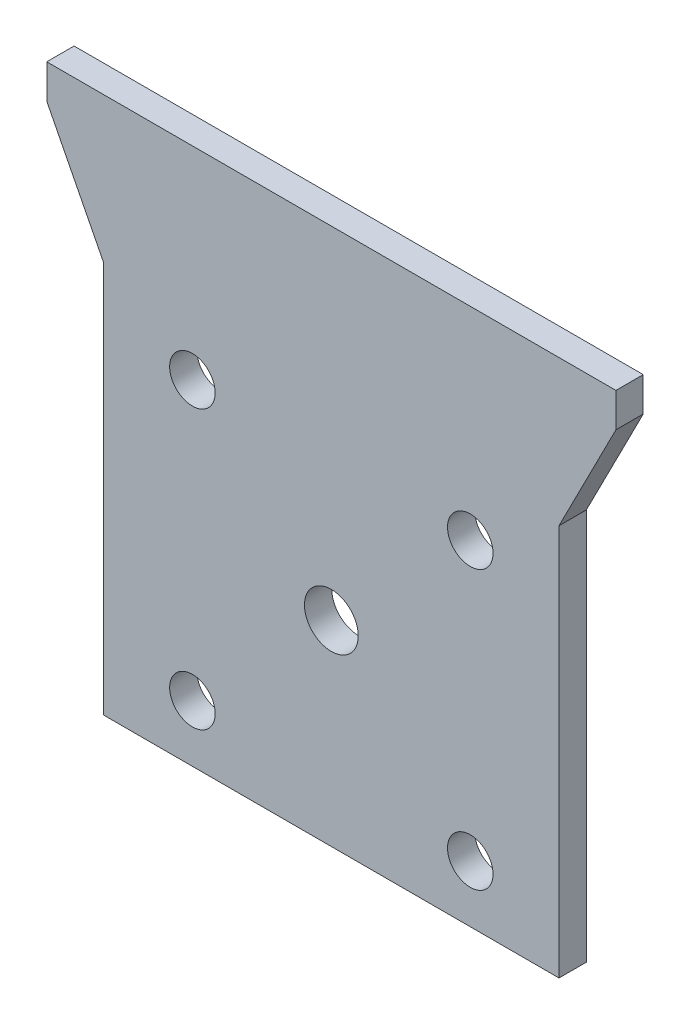
ISO-10303-21;
HEADER;
FILE_DESCRIPTION(('STEP AP214'),'2;1');
FILE_NAME('part.step','',(''),(''),'','','');
FILE_SCHEMA(('AUTOMOTIVE_DESIGN { 1 0 10303 214 1 1 1 1 }'));
ENDSEC;
DATA;
#1=APPLICATION_CONTEXT('core data for automotive mechanical design processes');
#2=APPLICATION_PROTOCOL_DEFINITION('international standard','automotive_design',2000,#1);
#3=PRODUCT_CONTEXT('',#1,'mechanical');
#4=PRODUCT('Part','Part','',(#3));
#5=PRODUCT_RELATED_PRODUCT_CATEGORY('part','',(#4));
#6=PRODUCT_DEFINITION_FORMATION('','',#4);
#7=PRODUCT_DEFINITION_CONTEXT('part definition',#1,'design');
#8=PRODUCT_DEFINITION('design','',#6,#7);
#9=PRODUCT_DEFINITION_SHAPE('','',#8);
#10=(LENGTH_UNIT() NAMED_UNIT(*) SI_UNIT(.MILLI.,.METRE.));
#11=(NAMED_UNIT(*) PLANE_ANGLE_UNIT() SI_UNIT($,.RADIAN.));
#12=(NAMED_UNIT(*) SI_UNIT($,.STERADIAN.) SOLID_ANGLE_UNIT());
#13=UNCERTAINTY_MEASURE_WITH_UNIT(LENGTH_MEASURE(1.E-05),#10,'distance_accuracy_value','');
#14=(GEOMETRIC_REPRESENTATION_CONTEXT(3) GLOBAL_UNCERTAINTY_ASSIGNED_CONTEXT((#13)) GLOBAL_UNIT_ASSIGNED_CONTEXT((#10,
#11,#12)) REPRESENTATION_CONTEXT('',''));
#15=CARTESIAN_POINT('',(0.,0.,0.));
#16=DIRECTION('',(0.,0.,1.));
#17=DIRECTION('',(1.,0.,0.));
#18=AXIS2_PLACEMENT_3D('',#15,#16,#17);
#19=CARTESIAN_POINT('',(0.,0.,3.048));
#20=DIRECTION('',(0.,0.,-1.));
#21=DIRECTION('',(-1.,0.,0.));
#22=AXIS2_PLACEMENT_3D('',#19,#20,#21);
#23=PLANE('',#22);
#24=CARTESIAN_POINT('',(-15.5,-15.5,3.048));
#25=DIRECTION('',(0.,0.,1.));
#26=DIRECTION('',(1.,0.,0.));
#27=AXIS2_PLACEMENT_3D('',#24,#25,#26);
#28=CIRCLE('',#27,2.54);
#29=CARTESIAN_POINT('',(-12.96,-15.5,3.048));
#30=VERTEX_POINT('',#29);
#31=EDGE_CURVE('E194',#30,#30,#28,.T.);
#32=ORIENTED_EDGE('',*,*,#31,.F.);
#33=EDGE_LOOP('',(#32));
#34=FACE_BOUND('',#33,.T.);
#35=CARTESIAN_POINT('',(15.5,15.5,3.048));
#36=DIRECTION('',(0.,0.,1.));
#37=DIRECTION('',(1.,0.,0.));
#38=AXIS2_PLACEMENT_3D('',#35,#36,#37);
#39=CIRCLE('',#38,2.54);
#40=CARTESIAN_POINT('',(18.04,15.5,3.048));
#41=VERTEX_POINT('',#40);
#42=EDGE_CURVE('E182',#41,#41,#39,.T.);
#43=ORIENTED_EDGE('',*,*,#42,.F.);
#44=EDGE_LOOP('',(#43));
#45=FACE_BOUND('',#44,.T.);
#46=DIRECTION('',(0.,-1.,0.));
#47=VECTOR('',#46,1.);
#48=CARTESIAN_POINT('',(-25.4,-21.85,3.048));
#49=LINE('',#48,#47);
#50=CARTESIAN_POINT('',(-25.4,21.85,3.048));
#51=VERTEX_POINT('',#50);
#52=CARTESIAN_POINT('',(-25.4,-21.85,3.048));
#53=VERTEX_POINT('',#52);
#54=EDGE_CURVE('E145',#51,#53,#49,.T.);
#55=ORIENTED_EDGE('',*,*,#54,.T.);
#56=DIRECTION('',(1.,0.,0.));
#57=VECTOR('',#56,1.);
#58=CARTESIAN_POINT('',(-25.4,-21.85,3.048));
#59=LINE('',#58,#57);
#60=CARTESIAN_POINT('',(25.4,-21.85,3.048));
#61=VERTEX_POINT('',#60);
#62=EDGE_CURVE('E93',#53,#61,#59,.T.);
#63=ORIENTED_EDGE('',*,*,#62,.T.);
#64=DIRECTION('',(0.,1.,0.));
#65=VECTOR('',#64,1.);
#66=CARTESIAN_POINT('',(25.4,-21.85,3.048));
#67=LINE('',#66,#65);
#68=CARTESIAN_POINT('',(25.4,21.85,3.048));
#69=VERTEX_POINT('',#68);
#70=EDGE_CURVE('E160',#61,#69,#67,.T.);
#71=ORIENTED_EDGE('',*,*,#70,.T.);
#72=DIRECTION('',(0.45464423975417,0.890673124809743,0.));
#73=VECTOR('',#72,1.);
#74=CARTESIAN_POINT('',(25.4,21.85,3.048));
#75=LINE('',#74,#73);
#76=CARTESIAN_POINT('',(31.75,34.29,3.048));
#77=VERTEX_POINT('',#76);
#78=EDGE_CURVE('E173',#69,#77,#75,.T.);
#79=ORIENTED_EDGE('',*,*,#78,.T.);
#80=DIRECTION('',(0.,1.,0.));
#81=VECTOR('',#80,1.);
#82=CARTESIAN_POINT('',(31.75,34.29,3.048));
#83=LINE('',#82,#81);
#84=CARTESIAN_POINT('',(31.75,38.1,3.048));
#85=VERTEX_POINT('',#84);
#86=EDGE_CURVE('E112',#77,#85,#83,.T.);
#87=ORIENTED_EDGE('',*,*,#86,.T.);
#88=DIRECTION('',(-1.,0.,0.));
#89=VECTOR('',#88,1.);
#90=CARTESIAN_POINT('',(-31.75,38.1,3.048));
#91=LINE('',#90,#89);
#92=CARTESIAN_POINT('',(-31.75,38.1,3.048));
#93=VERTEX_POINT('',#92);
#94=EDGE_CURVE('E106',#85,#93,#91,.T.);
#95=ORIENTED_EDGE('',*,*,#94,.T.);
#96=DIRECTION('',(0.,-1.,0.));
#97=VECTOR('',#96,1.);
#98=CARTESIAN_POINT('',(-31.75,34.29,3.048));
#99=LINE('',#98,#97);
#100=CARTESIAN_POINT('',(-31.75,34.29,3.048));
#101=VERTEX_POINT('',#100);
#102=EDGE_CURVE('E110',#93,#101,#99,.T.);
#103=ORIENTED_EDGE('',*,*,#102,.T.);
#104=DIRECTION('',(0.45464423975417,-0.890673124809743,0.));
#105=VECTOR('',#104,1.);
#106=CARTESIAN_POINT('',(-25.4,21.85,3.048));
#107=LINE('',#106,#105);
#108=EDGE_CURVE('E50',#101,#51,#107,.T.);
#109=ORIENTED_EDGE('',*,*,#108,.T.);
#110=EDGE_LOOP('',(#55,#63,#71,#79,#87,#95,#103,#109));
#111=FACE_BOUND('',#110,.T.);
#112=CARTESIAN_POINT('',(-15.5,15.5,3.048));
#113=DIRECTION('',(0.,0.,1.));
#114=DIRECTION('',(1.,0.,0.));
#115=AXIS2_PLACEMENT_3D('',#112,#113,#114);
#116=CIRCLE('',#115,2.54);
#117=CARTESIAN_POINT('',(-12.96,15.5,3.048));
#118=VERTEX_POINT('',#117);
#119=EDGE_CURVE('E134',#118,#118,#116,.T.);
#120=ORIENTED_EDGE('',*,*,#119,.F.);
#121=EDGE_LOOP('',(#120));
#122=FACE_BOUND('',#121,.T.);
#123=CARTESIAN_POINT('',(15.5,-15.5,3.048));
#124=DIRECTION('',(0.,0.,1.));
#125=DIRECTION('',(1.,0.,0.));
#126=AXIS2_PLACEMENT_3D('',#123,#124,#125);
#127=CIRCLE('',#126,2.54);
#128=CARTESIAN_POINT('',(18.04,-15.5,3.048));
#129=VERTEX_POINT('',#128);
#130=EDGE_CURVE('E188',#129,#129,#127,.T.);
#131=ORIENTED_EDGE('',*,*,#130,.F.);
#132=EDGE_LOOP('',(#131));
#133=FACE_BOUND('',#132,.T.);
#134=CARTESIAN_POINT('',(0.,0.,3.048));
#135=DIRECTION('',(0.,0.,1.));
#136=DIRECTION('',(1.,0.,0.));
#137=AXIS2_PLACEMENT_3D('',#134,#135,#136);
#138=CIRCLE('',#137,3.);
#139=CARTESIAN_POINT('',(3.,0.,3.048));
#140=VERTEX_POINT('',#139);
#141=EDGE_CURVE('E200',#140,#140,#138,.T.);
#142=ORIENTED_EDGE('',*,*,#141,.F.);
#143=EDGE_LOOP('',(#142));
#144=FACE_BOUND('',#143,.T.);
#145=ADVANCED_FACE('F33',(#34,#45,#111,#122,#133,#144),#23,.F.);
#146=CARTESIAN_POINT('',(0.,0.,0.));
#147=DIRECTION('',(0.,0.,-1.));
#148=DIRECTION('',(-1.,0.,0.));
#149=AXIS2_PLACEMENT_3D('',#146,#147,#148);
#150=PLANE('',#149);
#151=CARTESIAN_POINT('',(-15.5,-15.5,0.));
#152=DIRECTION('',(0.,0.,1.));
#153=DIRECTION('',(1.,0.,0.));
#154=AXIS2_PLACEMENT_3D('',#151,#152,#153);
#155=CIRCLE('',#154,2.54);
#156=CARTESIAN_POINT('',(-12.96,-15.5,0.));
#157=VERTEX_POINT('',#156);
#158=EDGE_CURVE('E197',#157,#157,#155,.T.);
#159=ORIENTED_EDGE('',*,*,#158,.T.);
#160=EDGE_LOOP('',(#159));
#161=FACE_BOUND('',#160,.T.);
#162=CARTESIAN_POINT('',(15.5,15.5,0.));
#163=DIRECTION('',(0.,0.,1.));
#164=DIRECTION('',(1.,0.,0.));
#165=AXIS2_PLACEMENT_3D('',#162,#163,#164);
#166=CIRCLE('',#165,2.54);
#167=CARTESIAN_POINT('',(18.04,15.5,0.));
#168=VERTEX_POINT('',#167);
#169=EDGE_CURVE('E185',#168,#168,#166,.T.);
#170=ORIENTED_EDGE('',*,*,#169,.T.);
#171=EDGE_LOOP('',(#170));
#172=FACE_BOUND('',#171,.T.);
#173=DIRECTION('',(0.,-1.,0.));
#174=VECTOR('',#173,1.);
#175=CARTESIAN_POINT('',(-25.4,-21.85,0.));
#176=LINE('',#175,#174);
#177=CARTESIAN_POINT('',(-25.4,21.85,0.));
#178=VERTEX_POINT('',#177);
#179=CARTESIAN_POINT('',(-25.4,-21.85,0.));
#180=VERTEX_POINT('',#179);
#181=EDGE_CURVE('E130',#178,#180,#176,.T.);
#182=ORIENTED_EDGE('',*,*,#181,.F.);
#183=DIRECTION('',(0.45464423975417,-0.890673124809743,0.));
#184=VECTOR('',#183,1.);
#185=CARTESIAN_POINT('',(-25.4,21.85,0.));
#186=LINE('',#185,#184);
#187=CARTESIAN_POINT('',(-31.75,34.29,0.));
#188=VERTEX_POINT('',#187);
#189=EDGE_CURVE('E85',#188,#178,#186,.T.);
#190=ORIENTED_EDGE('',*,*,#189,.F.);
#191=DIRECTION('',(0.,-1.,0.));
#192=VECTOR('',#191,1.);
#193=CARTESIAN_POINT('',(-31.75,34.29,0.));
#194=LINE('',#193,#192);
#195=CARTESIAN_POINT('',(-31.75,38.1,0.));
#196=VERTEX_POINT('',#195);
#197=EDGE_CURVE('E79',#196,#188,#194,.T.);
#198=ORIENTED_EDGE('',*,*,#197,.F.);
#199=DIRECTION('',(-1.,0.,0.));
#200=VECTOR('',#199,1.);
#201=CARTESIAN_POINT('',(-31.75,38.1,0.));
#202=LINE('',#201,#200);
#203=CARTESIAN_POINT('',(31.75,38.1,0.));
#204=VERTEX_POINT('',#203);
#205=EDGE_CURVE('E120',#204,#196,#202,.T.);
#206=ORIENTED_EDGE('',*,*,#205,.F.);
#207=DIRECTION('',(0.,1.,0.));
#208=VECTOR('',#207,1.);
#209=CARTESIAN_POINT('',(31.75,34.29,0.));
#210=LINE('',#209,#208);
#211=CARTESIAN_POINT('',(31.75,34.29,0.));
#212=VERTEX_POINT('',#211);
#213=EDGE_CURVE('E140',#212,#204,#210,.T.);
#214=ORIENTED_EDGE('',*,*,#213,.F.);
#215=DIRECTION('',(0.45464423975417,0.890673124809743,0.));
#216=VECTOR('',#215,1.);
#217=CARTESIAN_POINT('',(25.4,21.85,0.));
#218=LINE('',#217,#216);
#219=CARTESIAN_POINT('',(25.4,21.85,0.));
#220=VERTEX_POINT('',#219);
#221=EDGE_CURVE('E138',#220,#212,#218,.T.);
#222=ORIENTED_EDGE('',*,*,#221,.F.);
#223=DIRECTION('',(0.,1.,0.));
#224=VECTOR('',#223,1.);
#225=CARTESIAN_POINT('',(25.4,-21.85,0.));
#226=LINE('',#225,#224);
#227=CARTESIAN_POINT('',(25.4,-21.85,0.));
#228=VERTEX_POINT('',#227);
#229=EDGE_CURVE('E136',#228,#220,#226,.T.);
#230=ORIENTED_EDGE('',*,*,#229,.F.);
#231=DIRECTION('',(1.,0.,0.));
#232=VECTOR('',#231,1.);
#233=CARTESIAN_POINT('',(-25.4,-21.85,0.));
#234=LINE('',#233,#232);
#235=EDGE_CURVE('E133',#180,#228,#234,.T.);
#236=ORIENTED_EDGE('',*,*,#235,.F.);
#237=EDGE_LOOP('',(#182,#190,#198,#206,#214,#222,#230,#236));
#238=FACE_BOUND('',#237,.T.);
#239=CARTESIAN_POINT('',(-15.5,15.5,0.));
#240=DIRECTION('',(0.,0.,1.));
#241=DIRECTION('',(1.,0.,0.));
#242=AXIS2_PLACEMENT_3D('',#239,#240,#241);
#243=CIRCLE('',#242,2.54);
#244=CARTESIAN_POINT('',(-12.96,15.5,0.));
#245=VERTEX_POINT('',#244);
#246=EDGE_CURVE('E179',#245,#245,#243,.T.);
#247=ORIENTED_EDGE('',*,*,#246,.T.);
#248=EDGE_LOOP('',(#247));
#249=FACE_BOUND('',#248,.T.);
#250=CARTESIAN_POINT('',(15.5,-15.5,0.));
#251=DIRECTION('',(0.,0.,1.));
#252=DIRECTION('',(1.,0.,0.));
#253=AXIS2_PLACEMENT_3D('',#250,#251,#252);
#254=CIRCLE('',#253,2.54);
#255=CARTESIAN_POINT('',(18.04,-15.5,0.));
#256=VERTEX_POINT('',#255);
#257=EDGE_CURVE('E191',#256,#256,#254,.T.);
#258=ORIENTED_EDGE('',*,*,#257,.T.);
#259=EDGE_LOOP('',(#258));
#260=FACE_BOUND('',#259,.T.);
#261=CARTESIAN_POINT('',(0.,0.,0.));
#262=DIRECTION('',(0.,0.,1.));
#263=DIRECTION('',(1.,0.,0.));
#264=AXIS2_PLACEMENT_3D('',#261,#262,#263);
#265=CIRCLE('',#264,3.);
#266=CARTESIAN_POINT('',(3.,0.,0.));
#267=VERTEX_POINT('',#266);
#268=EDGE_CURVE('E203',#267,#267,#265,.T.);
#269=ORIENTED_EDGE('',*,*,#268,.T.);
#270=EDGE_LOOP('',(#269));
#271=FACE_BOUND('',#270,.T.);
#272=ADVANCED_FACE('F164',(#161,#172,#238,#249,#260,#271),#150,.T.);
#273=CARTESIAN_POINT('',(-25.4,-21.85,3.048));
#274=DIRECTION('',(1.,0.,0.));
#275=DIRECTION('',(0.,1.,0.));
#276=AXIS2_PLACEMENT_3D('',#273,#274,#275);
#277=PLANE('',#276);
#278=ORIENTED_EDGE('',*,*,#181,.T.);
#279=DIRECTION('',(0.,0.,-1.));
#280=VECTOR('',#279,1.);
#281=CARTESIAN_POINT('',(-25.4,-21.85,3.048));
#282=LINE('',#281,#280);
#283=EDGE_CURVE('E11',#53,#180,#282,.T.);
#284=ORIENTED_EDGE('',*,*,#283,.F.);
#285=ORIENTED_EDGE('',*,*,#54,.F.);
#286=DIRECTION('',(0.,0.,-1.));
#287=VECTOR('',#286,1.);
#288=CARTESIAN_POINT('',(-25.4,21.85,3.048));
#289=LINE('',#288,#287);
#290=EDGE_CURVE('E126',#51,#178,#289,.T.);
#291=ORIENTED_EDGE('',*,*,#290,.T.);
#292=EDGE_LOOP('',(#278,#284,#285,#291));
#293=FACE_BOUND('',#292,.T.);
#294=ADVANCED_FACE('F35',(#293),#277,.F.);
#295=CARTESIAN_POINT('',(-25.4,-21.85,3.048));
#296=DIRECTION('',(0.,1.,0.));
#297=DIRECTION('',(-1.,0.,0.));
#298=AXIS2_PLACEMENT_3D('',#295,#296,#297);
#299=PLANE('',#298);
#300=ORIENTED_EDGE('',*,*,#235,.T.);
#301=DIRECTION('',(0.,0.,-1.));
#302=VECTOR('',#301,1.);
#303=CARTESIAN_POINT('',(25.4,-21.85,3.048));
#304=LINE('',#303,#302);
#305=EDGE_CURVE('E42',#61,#228,#304,.T.);
#306=ORIENTED_EDGE('',*,*,#305,.F.);
#307=ORIENTED_EDGE('',*,*,#62,.F.);
#308=ORIENTED_EDGE('',*,*,#283,.T.);
#309=EDGE_LOOP('',(#300,#306,#307,#308));
#310=FACE_BOUND('',#309,.T.);
#311=ADVANCED_FACE('F238',(#310),#299,.F.);
#312=CARTESIAN_POINT('',(25.4,-21.85,3.048));
#313=DIRECTION('',(-1.,0.,0.));
#314=DIRECTION('',(0.,-1.,0.));
#315=AXIS2_PLACEMENT_3D('',#312,#313,#314);
#316=PLANE('',#315);
#317=ORIENTED_EDGE('',*,*,#229,.T.);
#318=DIRECTION('',(0.,0.,-1.));
#319=VECTOR('',#318,1.);
#320=CARTESIAN_POINT('',(25.4,21.85,3.048));
#321=LINE('',#320,#319);
#322=EDGE_CURVE('E152',#69,#220,#321,.T.);
#323=ORIENTED_EDGE('',*,*,#322,.F.);
#324=ORIENTED_EDGE('',*,*,#70,.F.);
#325=ORIENTED_EDGE('',*,*,#305,.T.);
#326=EDGE_LOOP('',(#317,#323,#324,#325));
#327=FACE_BOUND('',#326,.T.);
#328=ADVANCED_FACE('F158',(#327),#316,.F.);
#329=CARTESIAN_POINT('',(25.4,21.85,3.048));
#330=DIRECTION('',(-0.890673124809743,0.45464423975417,0.));
#331=DIRECTION('',(-0.45464423975417,-0.890673124809744,0.));
#332=AXIS2_PLACEMENT_3D('',#329,#330,#331);
#333=PLANE('',#332);
#334=ORIENTED_EDGE('',*,*,#221,.T.);
#335=DIRECTION('',(0.,0.,-1.));
#336=VECTOR('',#335,1.);
#337=CARTESIAN_POINT('',(31.75,34.29,3.048));
#338=LINE('',#337,#336);
#339=EDGE_CURVE('E149',#77,#212,#338,.T.);
#340=ORIENTED_EDGE('',*,*,#339,.F.);
#341=ORIENTED_EDGE('',*,*,#78,.F.);
#342=ORIENTED_EDGE('',*,*,#322,.T.);
#343=EDGE_LOOP('',(#334,#340,#341,#342));
#344=FACE_BOUND('',#343,.T.);
#345=ADVANCED_FACE('F169',(#344),#333,.F.);
#346=CARTESIAN_POINT('',(31.75,34.29,3.048));
#347=DIRECTION('',(-1.,0.,0.));
#348=DIRECTION('',(0.,0.,1.));
#349=AXIS2_PLACEMENT_3D('',#346,#347,#348);
#350=PLANE('',#349);
#351=ORIENTED_EDGE('',*,*,#213,.T.);
#352=DIRECTION('',(0.,0.,-1.));
#353=VECTOR('',#352,1.);
#354=CARTESIAN_POINT('',(31.75,38.1,3.048));
#355=LINE('',#354,#353);
#356=EDGE_CURVE('E121',#85,#204,#355,.T.);
#357=ORIENTED_EDGE('',*,*,#356,.F.);
#358=ORIENTED_EDGE('',*,*,#86,.F.);
#359=ORIENTED_EDGE('',*,*,#339,.T.);
#360=EDGE_LOOP('',(#351,#357,#358,#359));
#361=FACE_BOUND('',#360,.T.);
#362=ADVANCED_FACE('F172',(#361),#350,.F.);
#363=CARTESIAN_POINT('',(-31.75,38.1,3.048));
#364=DIRECTION('',(0.,-1.,0.));
#365=DIRECTION('',(1.,0.,0.));
#366=AXIS2_PLACEMENT_3D('',#363,#364,#365);
#367=PLANE('',#366);
#368=ORIENTED_EDGE('',*,*,#205,.T.);
#369=DIRECTION('',(0.,0.,-1.));
#370=VECTOR('',#369,1.);
#371=CARTESIAN_POINT('',(-31.75,38.1,3.048));
#372=LINE('',#371,#370);
#373=EDGE_CURVE('E117',#93,#196,#372,.T.);
#374=ORIENTED_EDGE('',*,*,#373,.F.);
#375=ORIENTED_EDGE('',*,*,#94,.F.);
#376=ORIENTED_EDGE('',*,*,#356,.T.);
#377=EDGE_LOOP('',(#368,#374,#375,#376));
#378=FACE_BOUND('',#377,.T.);
#379=ADVANCED_FACE('F118',(#378),#367,.F.);
#380=CARTESIAN_POINT('',(-31.75,34.29,3.048));
#381=DIRECTION('',(1.,0.,0.));
#382=DIRECTION('',(0.,0.,-1.));
#383=AXIS2_PLACEMENT_3D('',#380,#381,#382);
#384=PLANE('',#383);
#385=ORIENTED_EDGE('',*,*,#197,.T.);
#386=DIRECTION('',(0.,0.,-1.));
#387=VECTOR('',#386,1.);
#388=CARTESIAN_POINT('',(-31.75,34.29,3.048));
#389=LINE('',#388,#387);
#390=EDGE_CURVE('E122',#101,#188,#389,.T.);
#391=ORIENTED_EDGE('',*,*,#390,.F.);
#392=ORIENTED_EDGE('',*,*,#102,.F.);
#393=ORIENTED_EDGE('',*,*,#373,.T.);
#394=EDGE_LOOP('',(#385,#391,#392,#393));
#395=FACE_BOUND('',#394,.T.);
#396=ADVANCED_FACE('F124',(#395),#384,.F.);
#397=CARTESIAN_POINT('',(-25.4,21.85,3.048));
#398=DIRECTION('',(0.890673124809743,0.45464423975417,0.));
#399=DIRECTION('',(-0.45464423975417,0.890673124809743,0.));
#400=AXIS2_PLACEMENT_3D('',#397,#398,#399);
#401=PLANE('',#400);
#402=ORIENTED_EDGE('',*,*,#189,.T.);
#403=ORIENTED_EDGE('',*,*,#290,.F.);
#404=ORIENTED_EDGE('',*,*,#108,.F.);
#405=ORIENTED_EDGE('',*,*,#390,.T.);
#406=EDGE_LOOP('',(#402,#403,#404,#405));
#407=FACE_BOUND('',#406,.T.);
#408=ADVANCED_FACE('F226',(#407),#401,.F.);
#409=CARTESIAN_POINT('',(-15.5,15.5,3.048));
#410=DIRECTION('',(0.,0.,-1.));
#411=DIRECTION('',(-1.,0.,0.));
#412=AXIS2_PLACEMENT_3D('',#409,#410,#411);
#413=CYLINDRICAL_SURFACE('',#412,2.54);
#414=ORIENTED_EDGE('',*,*,#119,.T.);
#415=EDGE_LOOP('',(#414));
#416=FACE_BOUND('',#415,.T.);
#417=ORIENTED_EDGE('',*,*,#246,.F.);
#418=EDGE_LOOP('',(#417));
#419=FACE_BOUND('',#418,.T.);
#420=ADVANCED_FACE('F223',(#416,#419),#413,.F.);
#421=CARTESIAN_POINT('',(15.5,15.5,3.048));
#422=DIRECTION('',(0.,0.,-1.));
#423=DIRECTION('',(-1.,0.,0.));
#424=AXIS2_PLACEMENT_3D('',#421,#422,#423);
#425=CYLINDRICAL_SURFACE('',#424,2.54);
#426=ORIENTED_EDGE('',*,*,#42,.T.);
#427=EDGE_LOOP('',(#426));
#428=FACE_BOUND('',#427,.T.);
#429=ORIENTED_EDGE('',*,*,#169,.F.);
#430=EDGE_LOOP('',(#429));
#431=FACE_BOUND('',#430,.T.);
#432=ADVANCED_FACE('F302',(#428,#431),#425,.F.);
#433=CARTESIAN_POINT('',(15.5,-15.5,3.048));
#434=DIRECTION('',(0.,0.,-1.));
#435=DIRECTION('',(-1.,0.,0.));
#436=AXIS2_PLACEMENT_3D('',#433,#434,#435);
#437=CYLINDRICAL_SURFACE('',#436,2.54);
#438=ORIENTED_EDGE('',*,*,#130,.T.);
#439=EDGE_LOOP('',(#438));
#440=FACE_BOUND('',#439,.T.);
#441=ORIENTED_EDGE('',*,*,#257,.F.);
#442=EDGE_LOOP('',(#441));
#443=FACE_BOUND('',#442,.T.);
#444=ADVANCED_FACE('F310',(#440,#443),#437,.F.);
#445=CARTESIAN_POINT('',(-15.5,-15.5,3.048));
#446=DIRECTION('',(0.,0.,-1.));
#447=DIRECTION('',(-1.,0.,0.));
#448=AXIS2_PLACEMENT_3D('',#445,#446,#447);
#449=CYLINDRICAL_SURFACE('',#448,2.54);
#450=ORIENTED_EDGE('',*,*,#31,.T.);
#451=EDGE_LOOP('',(#450));
#452=FACE_BOUND('',#451,.T.);
#453=ORIENTED_EDGE('',*,*,#158,.F.);
#454=EDGE_LOOP('',(#453));
#455=FACE_BOUND('',#454,.T.);
#456=ADVANCED_FACE('F318',(#452,#455),#449,.F.);
#457=CARTESIAN_POINT('',(0.,0.,3.048));
#458=DIRECTION('',(0.,0.,-1.));
#459=DIRECTION('',(-1.,0.,0.));
#460=AXIS2_PLACEMENT_3D('',#457,#458,#459);
#461=CYLINDRICAL_SURFACE('',#460,3.);
#462=ORIENTED_EDGE('',*,*,#141,.T.);
#463=EDGE_LOOP('',(#462));
#464=FACE_BOUND('',#463,.T.);
#465=ORIENTED_EDGE('',*,*,#268,.F.);
#466=EDGE_LOOP('',(#465));
#467=FACE_BOUND('',#466,.T.);
#468=ADVANCED_FACE('F209',(#464,#467),#461,.F.);
#469=CLOSED_SHELL('',(#145,#272,#294,#311,#328,#345,#362,#379,#396,#408,#420,#432,#444,#456,#468));
#470=MANIFOLD_SOLID_BREP('B2',#469);
#471=ADVANCED_BREP_SHAPE_REPRESENTATION('',(#18,#470),#14);
#472=SHAPE_DEFINITION_REPRESENTATION(#9,#471);
ENDSEC;
END-ISO-10303-21;
